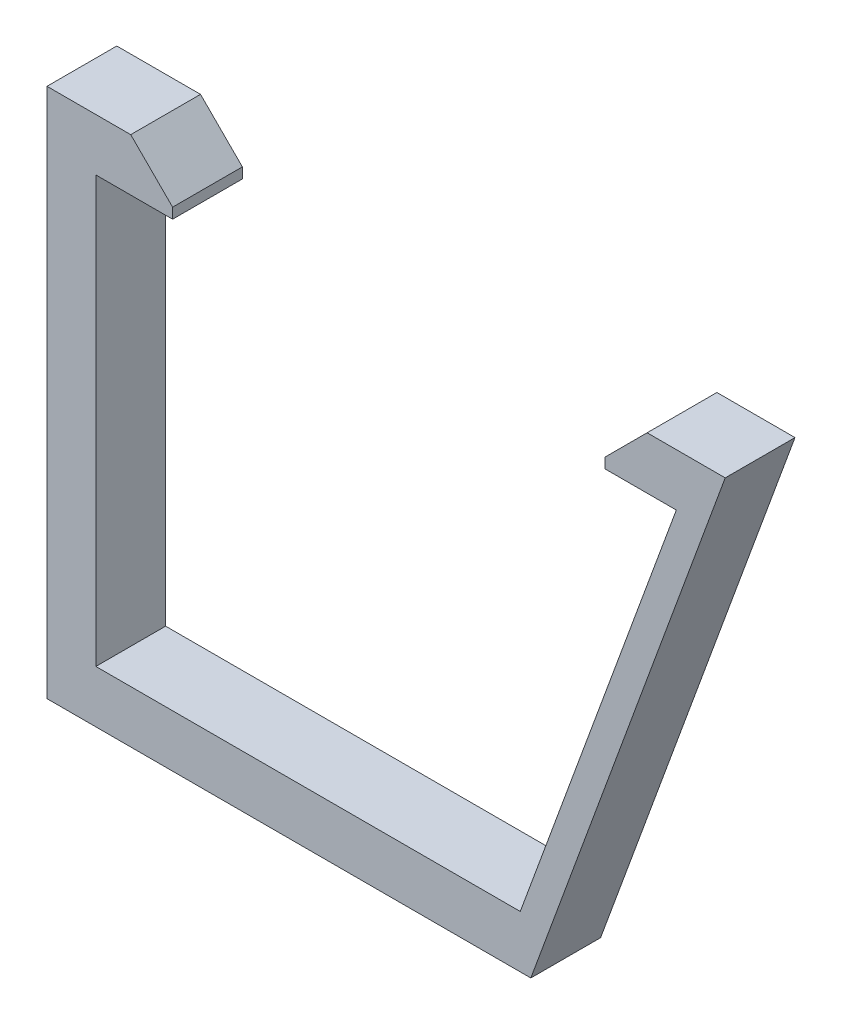
ISO-10303-21;
HEADER;
FILE_DESCRIPTION(('STEP AP214'),'2;1');
FILE_NAME('part.step','',(''),(''),'','','');
FILE_SCHEMA(('AUTOMOTIVE_DESIGN { 1 0 10303 214 1 1 1 1 }'));
ENDSEC;
DATA;
#1=APPLICATION_CONTEXT('core data for automotive mechanical design processes');
#2=APPLICATION_PROTOCOL_DEFINITION('international standard','automotive_design',2000,#1);
#3=PRODUCT_CONTEXT('',#1,'mechanical');
#4=PRODUCT('Part','Part','',(#3));
#5=PRODUCT_RELATED_PRODUCT_CATEGORY('part','',(#4));
#6=PRODUCT_DEFINITION_FORMATION('','',#4);
#7=PRODUCT_DEFINITION_CONTEXT('part definition',#1,'design');
#8=PRODUCT_DEFINITION('design','',#6,#7);
#9=PRODUCT_DEFINITION_SHAPE('','',#8);
#10=(LENGTH_UNIT() NAMED_UNIT(*) SI_UNIT(.MILLI.,.METRE.));
#11=(NAMED_UNIT(*) PLANE_ANGLE_UNIT() SI_UNIT($,.RADIAN.));
#12=(NAMED_UNIT(*) SI_UNIT($,.STERADIAN.) SOLID_ANGLE_UNIT());
#13=UNCERTAINTY_MEASURE_WITH_UNIT(LENGTH_MEASURE(1.E-05),#10,'distance_accuracy_value','');
#14=(GEOMETRIC_REPRESENTATION_CONTEXT(3) GLOBAL_UNCERTAINTY_ASSIGNED_CONTEXT((#13)) GLOBAL_UNIT_ASSIGNED_CONTEXT((#10,
#11,#12)) REPRESENTATION_CONTEXT('',''));
#15=CARTESIAN_POINT('',(0.,0.,0.));
#16=DIRECTION('',(0.,0.,1.));
#17=DIRECTION('',(1.,0.,0.));
#18=AXIS2_PLACEMENT_3D('',#15,#16,#17);
#19=CARTESIAN_POINT('',(0.,73.75,5.));
#20=DIRECTION('',(0.,1.,0.));
#21=DIRECTION('',(0.,0.,1.));
#22=AXIS2_PLACEMENT_3D('',#19,#20,#21);
#23=PLANE('',#22);
#24=DIRECTION('',(1.,0.,0.));
#25=VECTOR('',#24,1.);
#26=CARTESIAN_POINT('',(0.,73.75,0.));
#27=LINE('',#26,#25);
#28=CARTESIAN_POINT('',(-329.592548076923,73.75,0.));
#29=VERTEX_POINT('',#28);
#30=CARTESIAN_POINT('',(-299.181790865385,73.75,0.));
#31=VERTEX_POINT('',#30);
#32=EDGE_CURVE('E151',#29,#31,#27,.T.);
#33=ORIENTED_EDGE('',*,*,#32,.F.);
#34=DIRECTION('',(0.,0.,-1.));
#35=VECTOR('',#34,1.);
#36=CARTESIAN_POINT('',(-329.592548076923,73.75,5.));
#37=LINE('',#36,#35);
#38=CARTESIAN_POINT('',(-329.592548076923,73.75,5.));
#39=VERTEX_POINT('',#38);
#40=EDGE_CURVE('E146',#39,#29,#37,.T.);
#41=ORIENTED_EDGE('',*,*,#40,.F.);
#42=DIRECTION('',(1.,0.,0.));
#43=VECTOR('',#42,1.);
#44=CARTESIAN_POINT('',(0.,73.75,5.));
#45=LINE('',#44,#43);
#46=CARTESIAN_POINT('',(-299.181790865385,73.75,5.));
#47=VERTEX_POINT('',#46);
#48=EDGE_CURVE('E148',#39,#47,#45,.T.);
#49=ORIENTED_EDGE('',*,*,#48,.T.);
#50=DIRECTION('',(0.,0.,-1.));
#51=VECTOR('',#50,1.);
#52=CARTESIAN_POINT('',(-299.181790865385,73.75,5.));
#53=LINE('',#52,#51);
#54=EDGE_CURVE('E207',#47,#31,#53,.T.);
#55=ORIENTED_EDGE('',*,*,#54,.T.);
#56=EDGE_LOOP('',(#33,#41,#49,#55));
#57=FACE_BOUND('',#56,.T.);
#58=ADVANCED_FACE('F43',(#57),#23,.T.);
#59=CARTESIAN_POINT('',(-329.592548076923,0.,5.));
#60=DIRECTION('',(1.,0.,0.));
#61=DIRECTION('',(0.,0.,-1.));
#62=AXIS2_PLACEMENT_3D('',#59,#60,#61);
#63=PLANE('',#62);
#64=DIRECTION('',(0.,-1.,0.));
#65=VECTOR('',#64,1.);
#66=CARTESIAN_POINT('',(-329.592548076923,0.,0.));
#67=LINE('',#66,#65);
#68=CARTESIAN_POINT('',(-329.592548076923,104.25,0.));
#69=VERTEX_POINT('',#68);
#70=EDGE_CURVE('E210',#69,#29,#67,.T.);
#71=ORIENTED_EDGE('',*,*,#70,.F.);
#72=DIRECTION('',(0.,0.,-1.));
#73=VECTOR('',#72,1.);
#74=CARTESIAN_POINT('',(-329.592548076923,104.25,5.));
#75=LINE('',#74,#73);
#76=CARTESIAN_POINT('',(-329.592548076923,104.25,5.));
#77=VERTEX_POINT('',#76);
#78=EDGE_CURVE('E158',#77,#69,#75,.T.);
#79=ORIENTED_EDGE('',*,*,#78,.F.);
#80=DIRECTION('',(0.,-1.,0.));
#81=VECTOR('',#80,1.);
#82=CARTESIAN_POINT('',(-329.592548076923,0.,5.));
#83=LINE('',#82,#81);
#84=EDGE_CURVE('E163',#77,#39,#83,.T.);
#85=ORIENTED_EDGE('',*,*,#84,.T.);
#86=ORIENTED_EDGE('',*,*,#40,.T.);
#87=EDGE_LOOP('',(#71,#79,#85,#86));
#88=FACE_BOUND('',#87,.T.);
#89=ADVANCED_FACE('F169',(#88),#63,.T.);
#90=CARTESIAN_POINT('',(0.,104.25,5.));
#91=DIRECTION('',(0.,1.,0.));
#92=DIRECTION('',(0.,0.,1.));
#93=AXIS2_PLACEMENT_3D('',#90,#91,#92);
#94=PLANE('',#93);
#95=DIRECTION('',(1.,0.,0.));
#96=VECTOR('',#95,1.);
#97=CARTESIAN_POINT('',(0.,104.25,0.));
#98=LINE('',#97,#96);
#99=CARTESIAN_POINT('',(-324.092548076923,104.25,0.));
#100=VERTEX_POINT('',#99);
#101=EDGE_CURVE('E213',#69,#100,#98,.T.);
#102=ORIENTED_EDGE('',*,*,#101,.T.);
#103=DIRECTION('',(0.,0.,-1.));
#104=VECTOR('',#103,1.);
#105=CARTESIAN_POINT('',(-324.092548076923,104.25,5.));
#106=LINE('',#105,#104);
#107=CARTESIAN_POINT('',(-324.092548076923,104.25,5.));
#108=VERTEX_POINT('',#107);
#109=EDGE_CURVE('E270',#108,#100,#106,.T.);
#110=ORIENTED_EDGE('',*,*,#109,.F.);
#111=DIRECTION('',(1.,0.,0.));
#112=VECTOR('',#111,1.);
#113=CARTESIAN_POINT('',(0.,104.25,5.));
#114=LINE('',#113,#112);
#115=EDGE_CURVE('E172',#77,#108,#114,.T.);
#116=ORIENTED_EDGE('',*,*,#115,.F.);
#117=ORIENTED_EDGE('',*,*,#78,.T.);
#118=EDGE_LOOP('',(#102,#110,#116,#117));
#119=FACE_BOUND('',#118,.T.);
#120=ADVANCED_FACE('F338',(#119),#94,.F.);
#121=CARTESIAN_POINT('',(-324.092548076923,0.,5.));
#122=DIRECTION('',(-1.,0.,0.));
#123=DIRECTION('',(0.,0.,1.));
#124=AXIS2_PLACEMENT_3D('',#121,#122,#123);
#125=PLANE('',#124);
#126=DIRECTION('',(0.,1.,0.));
#127=VECTOR('',#126,1.);
#128=CARTESIAN_POINT('',(-324.092548076923,0.,0.));
#129=LINE('',#128,#127);
#130=CARTESIAN_POINT('',(-324.092548076923,105.,0.));
#131=VERTEX_POINT('',#130);
#132=EDGE_CURVE('E216',#100,#131,#129,.T.);
#133=ORIENTED_EDGE('',*,*,#132,.T.);
#134=DIRECTION('',(0.,0.,1.));
#135=VECTOR('',#134,1.);
#136=CARTESIAN_POINT('',(-324.092548076923,105.,5.));
#137=LINE('',#136,#135);
#138=CARTESIAN_POINT('',(-324.092548076923,105.,5.));
#139=VERTEX_POINT('',#138);
#140=EDGE_CURVE('E11',#131,#139,#137,.T.);
#141=ORIENTED_EDGE('',*,*,#140,.T.);
#142=DIRECTION('',(0.,1.,0.));
#143=VECTOR('',#142,1.);
#144=CARTESIAN_POINT('',(-324.092548076923,0.,5.));
#145=LINE('',#144,#143);
#146=EDGE_CURVE('E175',#108,#139,#145,.T.);
#147=ORIENTED_EDGE('',*,*,#146,.F.);
#148=ORIENTED_EDGE('',*,*,#109,.T.);
#149=EDGE_LOOP('',(#133,#141,#147,#148));
#150=FACE_BOUND('',#149,.T.);
#151=ADVANCED_FACE('F339',(#150),#125,.F.);
#152=CARTESIAN_POINT('',(0.,108.,5.));
#153=DIRECTION('',(0.,-1.,0.));
#154=DIRECTION('',(0.,0.,-1.));
#155=AXIS2_PLACEMENT_3D('',#152,#153,#154);
#156=PLANE('',#155);
#157=DIRECTION('',(-1.,0.,0.));
#158=VECTOR('',#157,1.);
#159=CARTESIAN_POINT('',(0.,108.,5.));
#160=LINE('',#159,#158);
#161=CARTESIAN_POINT('',(-327.092548076923,108.,5.));
#162=VERTEX_POINT('',#161);
#163=CARTESIAN_POINT('',(-333.092548076923,108.,5.));
#164=VERTEX_POINT('',#163);
#165=EDGE_CURVE('E180',#162,#164,#160,.T.);
#166=ORIENTED_EDGE('',*,*,#165,.F.);
#167=DIRECTION('',(0.,0.,-1.));
#168=VECTOR('',#167,1.);
#169=CARTESIAN_POINT('',(-327.092548076923,108.,5.));
#170=LINE('',#169,#168);
#171=CARTESIAN_POINT('',(-327.092548076923,108.,0.));
#172=VERTEX_POINT('',#171);
#173=EDGE_CURVE('E53',#162,#172,#170,.T.);
#174=ORIENTED_EDGE('',*,*,#173,.T.);
#175=DIRECTION('',(-1.,0.,0.));
#176=VECTOR('',#175,1.);
#177=CARTESIAN_POINT('',(0.,108.,0.));
#178=LINE('',#177,#176);
#179=CARTESIAN_POINT('',(-333.092548076923,108.,0.));
#180=VERTEX_POINT('',#179);
#181=EDGE_CURVE('E219',#172,#180,#178,.T.);
#182=ORIENTED_EDGE('',*,*,#181,.T.);
#183=DIRECTION('',(0.,0.,-1.));
#184=VECTOR('',#183,1.);
#185=CARTESIAN_POINT('',(-333.092548076923,108.,5.));
#186=LINE('',#185,#184);
#187=EDGE_CURVE('E266',#164,#180,#186,.T.);
#188=ORIENTED_EDGE('',*,*,#187,.F.);
#189=EDGE_LOOP('',(#166,#174,#182,#188));
#190=FACE_BOUND('',#189,.T.);
#191=ADVANCED_FACE('F297',(#190),#156,.F.);
#192=CARTESIAN_POINT('',(-333.092548076923,0.,5.));
#193=DIRECTION('',(-1.,0.,0.));
#194=DIRECTION('',(0.,0.,1.));
#195=AXIS2_PLACEMENT_3D('',#192,#193,#194);
#196=PLANE('',#195);
#197=DIRECTION('',(0.,1.,0.));
#198=VECTOR('',#197,1.);
#199=CARTESIAN_POINT('',(-333.092548076923,0.,0.));
#200=LINE('',#199,#198);
#201=CARTESIAN_POINT('',(-333.092548076923,70.,0.));
#202=VERTEX_POINT('',#201);
#203=EDGE_CURVE('E222',#202,#180,#200,.T.);
#204=ORIENTED_EDGE('',*,*,#203,.F.);
#205=DIRECTION('',(0.,0.,-1.));
#206=VECTOR('',#205,1.);
#207=CARTESIAN_POINT('',(-333.092548076923,70.,5.));
#208=LINE('',#207,#206);
#209=CARTESIAN_POINT('',(-333.092548076923,70.,5.));
#210=VERTEX_POINT('',#209);
#211=EDGE_CURVE('E263',#210,#202,#208,.T.);
#212=ORIENTED_EDGE('',*,*,#211,.F.);
#213=DIRECTION('',(0.,1.,0.));
#214=VECTOR('',#213,1.);
#215=CARTESIAN_POINT('',(-333.092548076923,0.,5.));
#216=LINE('',#215,#214);
#217=EDGE_CURVE('E183',#210,#164,#216,.T.);
#218=ORIENTED_EDGE('',*,*,#217,.T.);
#219=ORIENTED_EDGE('',*,*,#187,.T.);
#220=EDGE_LOOP('',(#204,#212,#218,#219));
#221=FACE_BOUND('',#220,.T.);
#222=ADVANCED_FACE('F306',(#221),#196,.T.);
#223=CARTESIAN_POINT('',(0.,70.,5.));
#224=DIRECTION('',(0.,-1.,0.));
#225=DIRECTION('',(0.,0.,-1.));
#226=AXIS2_PLACEMENT_3D('',#223,#224,#225);
#227=PLANE('',#226);
#228=DIRECTION('',(-1.,0.,0.));
#229=VECTOR('',#228,1.);
#230=CARTESIAN_POINT('',(0.,70.,0.));
#231=LINE('',#230,#229);
#232=CARTESIAN_POINT('',(-298.42633950716,70.,0.));
#233=VERTEX_POINT('',#232);
#234=EDGE_CURVE('E226',#233,#202,#231,.T.);
#235=ORIENTED_EDGE('',*,*,#234,.F.);
#236=DIRECTION('',(0.,0.,-1.));
#237=VECTOR('',#236,1.);
#238=CARTESIAN_POINT('',(-298.42633950716,70.,5.));
#239=LINE('',#238,#237);
#240=CARTESIAN_POINT('',(-298.42633950716,70.,5.));
#241=VERTEX_POINT('',#240);
#242=EDGE_CURVE('E260',#241,#233,#239,.T.);
#243=ORIENTED_EDGE('',*,*,#242,.F.);
#244=DIRECTION('',(-1.,0.,0.));
#245=VECTOR('',#244,1.);
#246=CARTESIAN_POINT('',(0.,70.,5.));
#247=LINE('',#246,#245);
#248=EDGE_CURVE('E187',#241,#210,#247,.T.);
#249=ORIENTED_EDGE('',*,*,#248,.T.);
#250=ORIENTED_EDGE('',*,*,#211,.T.);
#251=EDGE_LOOP('',(#235,#243,#249,#250));
#252=FACE_BOUND('',#251,.T.);
#253=ADVANCED_FACE('F311',(#252),#227,.T.);
#254=CARTESIAN_POINT('',(-285.694186734404,104.731642973549,5.));
#255=DIRECTION('',(0.938900629606548,-0.344188331766823,0.));
#256=DIRECTION('',(0.344188331766823,0.938900629606548,0.));
#257=AXIS2_PLACEMENT_3D('',#254,#255,#256);
#258=PLANE('',#257);
#259=DIRECTION('',(-0.344188331766823,-0.938900629606548,0.));
#260=VECTOR('',#259,1.);
#261=CARTESIAN_POINT('',(-285.694186734404,104.731642973549,0.));
#262=LINE('',#261,#260);
#263=CARTESIAN_POINT('',(-284.496051045621,108.,0.));
#264=VERTEX_POINT('',#263);
#265=EDGE_CURVE('E230',#264,#233,#262,.T.);
#266=ORIENTED_EDGE('',*,*,#265,.F.);
#267=DIRECTION('',(0.,0.,-1.));
#268=VECTOR('',#267,1.);
#269=CARTESIAN_POINT('',(-284.496051045621,108.,5.));
#270=LINE('',#269,#268);
#271=CARTESIAN_POINT('',(-284.496051045621,108.,5.));
#272=VERTEX_POINT('',#271);
#273=EDGE_CURVE('E257',#272,#264,#270,.T.);
#274=ORIENTED_EDGE('',*,*,#273,.F.);
#275=DIRECTION('',(-0.344188331766823,-0.938900629606548,0.));
#276=VECTOR('',#275,1.);
#277=CARTESIAN_POINT('',(-285.694186734404,104.731642973549,5.));
#278=LINE('',#277,#276);
#279=EDGE_CURVE('E191',#272,#241,#278,.T.);
#280=ORIENTED_EDGE('',*,*,#279,.T.);
#281=ORIENTED_EDGE('',*,*,#242,.T.);
#282=EDGE_LOOP('',(#266,#274,#280,#281));
#283=FACE_BOUND('',#282,.T.);
#284=ADVANCED_FACE('F314',(#283),#258,.T.);
#285=CARTESIAN_POINT('',(0.,108.,5.));
#286=DIRECTION('',(0.,-1.,0.));
#287=DIRECTION('',(0.,0.,-1.));
#288=AXIS2_PLACEMENT_3D('',#285,#286,#287);
#289=PLANE('',#288);
#290=DIRECTION('',(-1.,0.,0.));
#291=VECTOR('',#290,1.);
#292=CARTESIAN_POINT('',(0.,108.,0.));
#293=LINE('',#292,#291);
#294=CARTESIAN_POINT('',(-290.092548076923,108.,0.));
#295=VERTEX_POINT('',#294);
#296=EDGE_CURVE('E234',#264,#295,#293,.T.);
#297=ORIENTED_EDGE('',*,*,#296,.T.);
#298=DIRECTION('',(0.,0.,1.));
#299=VECTOR('',#298,1.);
#300=CARTESIAN_POINT('',(-290.092548076923,108.,5.));
#301=LINE('',#300,#299);
#302=CARTESIAN_POINT('',(-290.092548076923,108.,5.));
#303=VERTEX_POINT('',#302);
#304=EDGE_CURVE('E285',#295,#303,#301,.T.);
#305=ORIENTED_EDGE('',*,*,#304,.T.);
#306=DIRECTION('',(-1.,0.,0.));
#307=VECTOR('',#306,1.);
#308=CARTESIAN_POINT('',(0.,108.,5.));
#309=LINE('',#308,#307);
#310=EDGE_CURVE('E195',#272,#303,#309,.T.);
#311=ORIENTED_EDGE('',*,*,#310,.F.);
#312=ORIENTED_EDGE('',*,*,#273,.T.);
#313=EDGE_LOOP('',(#297,#305,#311,#312));
#314=FACE_BOUND('',#313,.T.);
#315=ADVANCED_FACE('F368',(#314),#289,.F.);
#316=CARTESIAN_POINT('',(-293.092548076923,0.,5.));
#317=DIRECTION('',(-1.,0.,0.));
#318=DIRECTION('',(0.,0.,1.));
#319=AXIS2_PLACEMENT_3D('',#316,#317,#318);
#320=PLANE('',#319);
#321=DIRECTION('',(0.,1.,0.));
#322=VECTOR('',#321,1.);
#323=CARTESIAN_POINT('',(-293.092548076923,0.,5.));
#324=LINE('',#323,#322);
#325=CARTESIAN_POINT('',(-293.092548076923,104.25,5.));
#326=VERTEX_POINT('',#325);
#327=CARTESIAN_POINT('',(-293.092548076923,105.,5.));
#328=VERTEX_POINT('',#327);
#329=EDGE_CURVE('E198',#326,#328,#324,.T.);
#330=ORIENTED_EDGE('',*,*,#329,.T.);
#331=DIRECTION('',(0.,0.,-1.));
#332=VECTOR('',#331,1.);
#333=CARTESIAN_POINT('',(-293.092548076923,105.,0.));
#334=LINE('',#333,#332);
#335=CARTESIAN_POINT('',(-293.092548076923,105.,0.));
#336=VERTEX_POINT('',#335);
#337=EDGE_CURVE('E157',#328,#336,#334,.T.);
#338=ORIENTED_EDGE('',*,*,#337,.T.);
#339=DIRECTION('',(0.,1.,0.));
#340=VECTOR('',#339,1.);
#341=CARTESIAN_POINT('',(-293.092548076923,0.,0.));
#342=LINE('',#341,#340);
#343=CARTESIAN_POINT('',(-293.092548076923,104.25,0.));
#344=VERTEX_POINT('',#343);
#345=EDGE_CURVE('E238',#344,#336,#342,.T.);
#346=ORIENTED_EDGE('',*,*,#345,.F.);
#347=DIRECTION('',(0.,0.,-1.));
#348=VECTOR('',#347,1.);
#349=CARTESIAN_POINT('',(-293.092548076923,104.25,5.));
#350=LINE('',#349,#348);
#351=EDGE_CURVE('E254',#326,#344,#350,.T.);
#352=ORIENTED_EDGE('',*,*,#351,.F.);
#353=EDGE_LOOP('',(#330,#338,#346,#352));
#354=FACE_BOUND('',#353,.T.);
#355=ADVANCED_FACE('F325',(#354),#320,.T.);
#356=CARTESIAN_POINT('',(0.,104.25,5.));
#357=DIRECTION('',(0.,1.,0.));
#358=DIRECTION('',(0.,0.,1.));
#359=AXIS2_PLACEMENT_3D('',#356,#357,#358);
#360=PLANE('',#359);
#361=DIRECTION('',(1.,0.,0.));
#362=VECTOR('',#361,1.);
#363=CARTESIAN_POINT('',(0.,104.25,0.));
#364=LINE('',#363,#362);
#365=CARTESIAN_POINT('',(-288.000901442308,104.25,0.));
#366=VERTEX_POINT('',#365);
#367=EDGE_CURVE('E242',#344,#366,#364,.T.);
#368=ORIENTED_EDGE('',*,*,#367,.T.);
#369=DIRECTION('',(0.,0.,-1.));
#370=VECTOR('',#369,1.);
#371=CARTESIAN_POINT('',(-288.000901442308,104.25,5.));
#372=LINE('',#371,#370);
#373=CARTESIAN_POINT('',(-288.000901442308,104.25,5.));
#374=VERTEX_POINT('',#373);
#375=EDGE_CURVE('E251',#374,#366,#372,.T.);
#376=ORIENTED_EDGE('',*,*,#375,.F.);
#377=DIRECTION('',(1.,0.,0.));
#378=VECTOR('',#377,1.);
#379=CARTESIAN_POINT('',(0.,104.25,5.));
#380=LINE('',#379,#378);
#381=EDGE_CURVE('E202',#326,#374,#380,.T.);
#382=ORIENTED_EDGE('',*,*,#381,.F.);
#383=ORIENTED_EDGE('',*,*,#351,.T.);
#384=EDGE_LOOP('',(#368,#376,#382,#383));
#385=FACE_BOUND('',#384,.T.);
#386=ADVANCED_FACE('F331',(#385),#360,.F.);
#387=CARTESIAN_POINT('',(-287.571987993617,105.420019637084,5.));
#388=DIRECTION('',(-0.938900629606547,0.344188331766825,0.));
#389=DIRECTION('',(-0.344188331766825,-0.938900629606547,0.));
#390=AXIS2_PLACEMENT_3D('',#387,#388,#389);
#391=PLANE('',#390);
#392=DIRECTION('',(0.344188331766825,0.938900629606547,0.));
#393=VECTOR('',#392,1.);
#394=CARTESIAN_POINT('',(-287.571987993617,105.420019637084,0.));
#395=LINE('',#394,#393);
#396=EDGE_CURVE('E167',#31,#366,#395,.T.);
#397=ORIENTED_EDGE('',*,*,#396,.F.);
#398=ORIENTED_EDGE('',*,*,#54,.F.);
#399=DIRECTION('',(0.344188331766825,0.938900629606547,0.));
#400=VECTOR('',#399,1.);
#401=CARTESIAN_POINT('',(-287.571987993617,105.420019637084,5.));
#402=LINE('',#401,#400);
#403=EDGE_CURVE('E165',#47,#374,#402,.T.);
#404=ORIENTED_EDGE('',*,*,#403,.T.);
#405=ORIENTED_EDGE('',*,*,#375,.T.);
#406=EDGE_LOOP('',(#397,#398,#404,#405));
#407=FACE_BOUND('',#406,.T.);
#408=ADVANCED_FACE('F334',(#407),#391,.T.);
#409=CARTESIAN_POINT('',(0.,0.,5.));
#410=DIRECTION('',(0.,0.,1.));
#411=DIRECTION('',(1.,0.,0.));
#412=AXIS2_PLACEMENT_3D('',#409,#410,#411);
#413=PLANE('',#412);
#414=ORIENTED_EDGE('',*,*,#310,.T.);
#415=DIRECTION('',(-0.707106781186549,-0.707106781186546,0.));
#416=VECTOR('',#415,1.);
#417=CARTESIAN_POINT('',(-199.046274038461,199.046274038462,5.));
#418=LINE('',#417,#416);
#419=EDGE_CURVE('E290',#303,#328,#418,.T.);
#420=ORIENTED_EDGE('',*,*,#419,.T.);
#421=ORIENTED_EDGE('',*,*,#329,.F.);
#422=ORIENTED_EDGE('',*,*,#381,.T.);
#423=ORIENTED_EDGE('',*,*,#403,.F.);
#424=ORIENTED_EDGE('',*,*,#48,.F.);
#425=ORIENTED_EDGE('',*,*,#84,.F.);
#426=ORIENTED_EDGE('',*,*,#115,.T.);
#427=ORIENTED_EDGE('',*,*,#146,.T.);
#428=DIRECTION('',(0.707106781186549,-0.707106781186546,0.));
#429=VECTOR('',#428,1.);
#430=CARTESIAN_POINT('',(-109.546274038461,-109.546274038461,5.));
#431=LINE('',#430,#429);
#432=EDGE_CURVE('E60',#139,#162,#431,.F.);
#433=ORIENTED_EDGE('',*,*,#432,.T.);
#434=ORIENTED_EDGE('',*,*,#165,.T.);
#435=ORIENTED_EDGE('',*,*,#217,.F.);
#436=ORIENTED_EDGE('',*,*,#248,.F.);
#437=ORIENTED_EDGE('',*,*,#279,.F.);
#438=EDGE_LOOP('',(#414,#420,#421,#422,#423,#424,#425,#426,#427,#433,#434,#435,#436,#437));
#439=FACE_BOUND('',#438,.T.);
#440=ADVANCED_FACE('F162',(#439),#413,.T.);
#441=CARTESIAN_POINT('',(0.,0.,0.));
#442=DIRECTION('',(0.,0.,1.));
#443=DIRECTION('',(1.,0.,0.));
#444=AXIS2_PLACEMENT_3D('',#441,#442,#443);
#445=PLANE('',#444);
#446=ORIENTED_EDGE('',*,*,#345,.T.);
#447=DIRECTION('',(0.707106781186549,0.707106781186546,0.));
#448=VECTOR('',#447,1.);
#449=CARTESIAN_POINT('',(-293.092548076923,105.,0.));
#450=LINE('',#449,#448);
#451=EDGE_CURVE('E282',#336,#295,#450,.T.);
#452=ORIENTED_EDGE('',*,*,#451,.T.);
#453=ORIENTED_EDGE('',*,*,#296,.F.);
#454=ORIENTED_EDGE('',*,*,#265,.T.);
#455=ORIENTED_EDGE('',*,*,#234,.T.);
#456=ORIENTED_EDGE('',*,*,#203,.T.);
#457=ORIENTED_EDGE('',*,*,#181,.F.);
#458=DIRECTION('',(-0.707106781186549,0.707106781186546,0.));
#459=VECTOR('',#458,1.);
#460=CARTESIAN_POINT('',(-327.092548076923,108.,0.));
#461=LINE('',#460,#459);
#462=EDGE_CURVE('E279',#172,#131,#461,.F.);
#463=ORIENTED_EDGE('',*,*,#462,.T.);
#464=ORIENTED_EDGE('',*,*,#132,.F.);
#465=ORIENTED_EDGE('',*,*,#101,.F.);
#466=ORIENTED_EDGE('',*,*,#70,.T.);
#467=ORIENTED_EDGE('',*,*,#32,.T.);
#468=ORIENTED_EDGE('',*,*,#396,.T.);
#469=ORIENTED_EDGE('',*,*,#367,.F.);
#470=EDGE_LOOP('',(#446,#452,#453,#454,#455,#456,#457,#463,#464,#465,#466,#467,#468,#469));
#471=FACE_BOUND('',#470,.T.);
#472=ADVANCED_FACE('F301',(#471),#445,.F.);
#473=CARTESIAN_POINT('',(-293.092548076923,105.,5.));
#474=DIRECTION('',(-0.707106781186546,0.707106781186549,0.));
#475=DIRECTION('',(0.,0.,1.));
#476=AXIS2_PLACEMENT_3D('',#473,#474,#475);
#477=PLANE('',#476);
#478=ORIENTED_EDGE('',*,*,#419,.F.);
#479=ORIENTED_EDGE('',*,*,#304,.F.);
#480=ORIENTED_EDGE('',*,*,#451,.F.);
#481=ORIENTED_EDGE('',*,*,#337,.F.);
#482=EDGE_LOOP('',(#478,#479,#480,#481));
#483=FACE_BOUND('',#482,.T.);
#484=ADVANCED_FACE('F322',(#483),#477,.T.);
#485=CARTESIAN_POINT('',(-327.092548076923,108.,5.));
#486=DIRECTION('',(-0.707106781186546,-0.707106781186549,0.));
#487=DIRECTION('',(0.,0.,-1.));
#488=AXIS2_PLACEMENT_3D('',#485,#486,#487);
#489=PLANE('',#488);
#490=ORIENTED_EDGE('',*,*,#432,.F.);
#491=ORIENTED_EDGE('',*,*,#140,.F.);
#492=ORIENTED_EDGE('',*,*,#462,.F.);
#493=ORIENTED_EDGE('',*,*,#173,.F.);
#494=EDGE_LOOP('',(#490,#491,#492,#493));
#495=FACE_BOUND('',#494,.T.);
#496=ADVANCED_FACE('F46',(#495),#489,.F.);
#497=CLOSED_SHELL('',(#58,#89,#120,#151,#191,#222,#253,#284,#315,#355,#386,#408,#440,#472,#484,#496));
#498=MANIFOLD_SOLID_BREP('B2',#497);
#499=ADVANCED_BREP_SHAPE_REPRESENTATION('',(#18,#498),#14);
#500=SHAPE_DEFINITION_REPRESENTATION(#9,#499);
ENDSEC;
END-ISO-10303-21;
